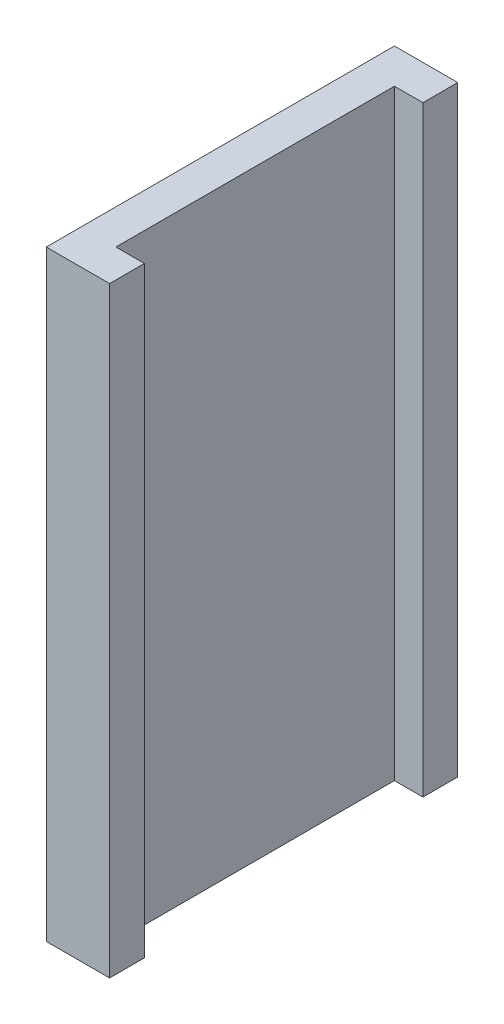
ISO-10303-21;
HEADER;
FILE_DESCRIPTION(('STEP AP214'),'2;1');
FILE_NAME('part.step','',(''),(''),'','','');
FILE_SCHEMA(('AUTOMOTIVE_DESIGN { 1 0 10303 214 1 1 1 1 }'));
ENDSEC;
DATA;
#1=APPLICATION_CONTEXT('core data for automotive mechanical design processes');
#2=APPLICATION_PROTOCOL_DEFINITION('international standard','automotive_design',2000,#1);
#3=PRODUCT_CONTEXT('',#1,'mechanical');
#4=PRODUCT('Part','Part','',(#3));
#5=PRODUCT_RELATED_PRODUCT_CATEGORY('part','',(#4));
#6=PRODUCT_DEFINITION_FORMATION('','',#4);
#7=PRODUCT_DEFINITION_CONTEXT('part definition',#1,'design');
#8=PRODUCT_DEFINITION('design','',#6,#7);
#9=PRODUCT_DEFINITION_SHAPE('','',#8);
#10=(LENGTH_UNIT() NAMED_UNIT(*) SI_UNIT(.MILLI.,.METRE.));
#11=(NAMED_UNIT(*) PLANE_ANGLE_UNIT() SI_UNIT($,.RADIAN.));
#12=(NAMED_UNIT(*) SI_UNIT($,.STERADIAN.) SOLID_ANGLE_UNIT());
#13=UNCERTAINTY_MEASURE_WITH_UNIT(LENGTH_MEASURE(1.E-05),#10,'distance_accuracy_value','');
#14=(GEOMETRIC_REPRESENTATION_CONTEXT(3) GLOBAL_UNCERTAINTY_ASSIGNED_CONTEXT((#13)) GLOBAL_UNIT_ASSIGNED_CONTEXT((#10,
#11,#12)) REPRESENTATION_CONTEXT('',''));
#15=CARTESIAN_POINT('',(0.,0.,0.));
#16=DIRECTION('',(0.,0.,1.));
#17=DIRECTION('',(1.,0.,0.));
#18=AXIS2_PLACEMENT_3D('',#15,#16,#17);
#19=CARTESIAN_POINT('',(0.1,0.,0.));
#20=DIRECTION('',(1.,0.,0.));
#21=DIRECTION('',(0.,0.,-1.));
#22=AXIS2_PLACEMENT_3D('',#19,#20,#21);
#23=PLANE('',#22);
#24=DIRECTION('',(0.,0.,1.));
#25=VECTOR('',#24,1.);
#26=CARTESIAN_POINT('',(0.1,0.95,0.));
#27=LINE('',#26,#25);
#28=CARTESIAN_POINT('',(0.1,0.95,0.055));
#29=VERTEX_POINT('',#28);
#30=CARTESIAN_POINT('',(0.1,0.95,0.));
#31=VERTEX_POINT('',#30);
#32=EDGE_CURVE('E100',#29,#31,#27,.F.);
#33=ORIENTED_EDGE('',*,*,#32,.F.);
#34=DIRECTION('',(0.,1.,0.));
#35=VECTOR('',#34,1.);
#36=CARTESIAN_POINT('',(0.1,0.,0.055));
#37=LINE('',#36,#35);
#38=CARTESIAN_POINT('',(0.1,0.,0.055));
#39=VERTEX_POINT('',#38);
#40=EDGE_CURVE('E99',#39,#29,#37,.T.);
#41=ORIENTED_EDGE('',*,*,#40,.F.);
#42=DIRECTION('',(0.,0.,1.));
#43=VECTOR('',#42,1.);
#44=CARTESIAN_POINT('',(0.1,0.,0.));
#45=LINE('',#44,#43);
#46=CARTESIAN_POINT('',(0.1,0.,0.));
#47=VERTEX_POINT('',#46);
#48=EDGE_CURVE('E84',#39,#47,#45,.F.);
#49=ORIENTED_EDGE('',*,*,#48,.T.);
#50=DIRECTION('',(0.,1.,0.));
#51=VECTOR('',#50,1.);
#52=CARTESIAN_POINT('',(0.1,0.,0.));
#53=LINE('',#52,#51);
#54=EDGE_CURVE('E110',#47,#31,#53,.T.);
#55=ORIENTED_EDGE('',*,*,#54,.T.);
#56=EDGE_LOOP('',(#33,#41,#49,#55));
#57=FACE_BOUND('',#56,.T.);
#58=ADVANCED_FACE('F17',(#57),#23,.T.);
#59=CARTESIAN_POINT('',(0.055,0.,0.495));
#60=DIRECTION('',(0.,0.,1.));
#61=DIRECTION('',(1.,0.,0.));
#62=AXIS2_PLACEMENT_3D('',#59,#60,#61);
#63=PLANE('',#62);
#64=DIRECTION('',(1.,0.,0.));
#65=VECTOR('',#64,1.);
#66=CARTESIAN_POINT('',(0.,0.,0.495));
#67=LINE('',#66,#65);
#68=CARTESIAN_POINT('',(0.1,0.,0.495));
#69=VERTEX_POINT('',#68);
#70=CARTESIAN_POINT('',(0.055,0.,0.495));
#71=VERTEX_POINT('',#70);
#72=EDGE_CURVE('E112',#69,#71,#67,.F.);
#73=ORIENTED_EDGE('',*,*,#72,.T.);
#74=DIRECTION('',(0.,1.,0.));
#75=VECTOR('',#74,1.);
#76=CARTESIAN_POINT('',(0.055,0.,0.495));
#77=LINE('',#76,#75);
#78=CARTESIAN_POINT('',(0.055,0.95,0.495));
#79=VERTEX_POINT('',#78);
#80=EDGE_CURVE('E20',#79,#71,#77,.F.);
#81=ORIENTED_EDGE('',*,*,#80,.F.);
#82=DIRECTION('',(1.,0.,0.));
#83=VECTOR('',#82,1.);
#84=CARTESIAN_POINT('',(0.,0.95,0.495));
#85=LINE('',#84,#83);
#86=CARTESIAN_POINT('',(0.1,0.95,0.495));
#87=VERTEX_POINT('',#86);
#88=EDGE_CURVE('E226',#87,#79,#85,.F.);
#89=ORIENTED_EDGE('',*,*,#88,.F.);
#90=DIRECTION('',(0.,1.,0.));
#91=VECTOR('',#90,1.);
#92=CARTESIAN_POINT('',(0.1,0.,0.495));
#93=LINE('',#92,#91);
#94=EDGE_CURVE('E78',#69,#87,#93,.T.);
#95=ORIENTED_EDGE('',*,*,#94,.F.);
#96=EDGE_LOOP('',(#73,#81,#89,#95));
#97=FACE_BOUND('',#96,.T.);
#98=ADVANCED_FACE('F124',(#97),#63,.F.);
#99=CARTESIAN_POINT('',(0.055,0.,0.055));
#100=DIRECTION('',(1.,0.,0.));
#101=DIRECTION('',(0.,0.,-1.));
#102=AXIS2_PLACEMENT_3D('',#99,#100,#101);
#103=PLANE('',#102);
#104=DIRECTION('',(0.,0.,1.));
#105=VECTOR('',#104,1.);
#106=CARTESIAN_POINT('',(0.055,0.95,0.));
#107=LINE('',#106,#105);
#108=CARTESIAN_POINT('',(0.055,0.95,0.055));
#109=VERTEX_POINT('',#108);
#110=EDGE_CURVE('E123',#79,#109,#107,.F.);
#111=ORIENTED_EDGE('',*,*,#110,.F.);
#112=ORIENTED_EDGE('',*,*,#80,.T.);
#113=DIRECTION('',(0.,0.,1.));
#114=VECTOR('',#113,1.);
#115=CARTESIAN_POINT('',(0.055,0.,0.));
#116=LINE('',#115,#114);
#117=CARTESIAN_POINT('',(0.055,0.,0.055));
#118=VERTEX_POINT('',#117);
#119=EDGE_CURVE('E108',#71,#118,#116,.F.);
#120=ORIENTED_EDGE('',*,*,#119,.T.);
#121=DIRECTION('',(0.,1.,0.));
#122=VECTOR('',#121,1.);
#123=CARTESIAN_POINT('',(0.055,0.,0.055));
#124=LINE('',#123,#122);
#125=EDGE_CURVE('E104',#109,#118,#124,.F.);
#126=ORIENTED_EDGE('',*,*,#125,.F.);
#127=EDGE_LOOP('',(#111,#112,#120,#126));
#128=FACE_BOUND('',#127,.T.);
#129=ADVANCED_FACE('F122',(#128),#103,.T.);
#130=CARTESIAN_POINT('',(0.055,0.,0.055));
#131=DIRECTION('',(0.,0.,1.));
#132=DIRECTION('',(1.,0.,0.));
#133=AXIS2_PLACEMENT_3D('',#130,#131,#132);
#134=PLANE('',#133);
#135=DIRECTION('',(1.,0.,0.));
#136=VECTOR('',#135,1.);
#137=CARTESIAN_POINT('',(0.,0.,0.055));
#138=LINE('',#137,#136);
#139=EDGE_CURVE('E89',#118,#39,#138,.T.);
#140=ORIENTED_EDGE('',*,*,#139,.T.);
#141=ORIENTED_EDGE('',*,*,#40,.T.);
#142=DIRECTION('',(1.,0.,0.));
#143=VECTOR('',#142,1.);
#144=CARTESIAN_POINT('',(0.,0.95,0.055));
#145=LINE('',#144,#143);
#146=EDGE_CURVE('E240',#109,#29,#145,.T.);
#147=ORIENTED_EDGE('',*,*,#146,.F.);
#148=ORIENTED_EDGE('',*,*,#125,.T.);
#149=EDGE_LOOP('',(#140,#141,#147,#148));
#150=FACE_BOUND('',#149,.T.);
#151=ADVANCED_FACE('F106',(#150),#134,.T.);
#152=CARTESIAN_POINT('',(0.1,0.,0.));
#153=DIRECTION('',(1.,0.,0.));
#154=DIRECTION('',(0.,0.,-1.));
#155=AXIS2_PLACEMENT_3D('',#152,#153,#154);
#156=PLANE('',#155);
#157=DIRECTION('',(0.,0.,1.));
#158=VECTOR('',#157,1.);
#159=CARTESIAN_POINT('',(0.1,0.95,0.));
#160=LINE('',#159,#158);
#161=CARTESIAN_POINT('',(0.1,0.95,0.55));
#162=VERTEX_POINT('',#161);
#163=EDGE_CURVE('E224',#162,#87,#160,.F.);
#164=ORIENTED_EDGE('',*,*,#163,.F.);
#165=DIRECTION('',(0.,1.,0.));
#166=VECTOR('',#165,1.);
#167=CARTESIAN_POINT('',(0.1,0.,0.55));
#168=LINE('',#167,#166);
#169=CARTESIAN_POINT('',(0.1,0.,0.55));
#170=VERTEX_POINT('',#169);
#171=EDGE_CURVE('E225',#170,#162,#168,.T.);
#172=ORIENTED_EDGE('',*,*,#171,.F.);
#173=DIRECTION('',(0.,0.,1.));
#174=VECTOR('',#173,1.);
#175=CARTESIAN_POINT('',(0.1,0.,0.));
#176=LINE('',#175,#174);
#177=EDGE_CURVE('E96',#170,#69,#176,.F.);
#178=ORIENTED_EDGE('',*,*,#177,.T.);
#179=ORIENTED_EDGE('',*,*,#94,.T.);
#180=EDGE_LOOP('',(#164,#172,#178,#179));
#181=FACE_BOUND('',#180,.T.);
#182=ADVANCED_FACE('F153',(#181),#156,.T.);
#183=CARTESIAN_POINT('',(0.,0.,0.));
#184=DIRECTION('',(0.,1.,0.));
#185=DIRECTION('',(0.,0.,1.));
#186=AXIS2_PLACEMENT_3D('',#183,#184,#185);
#187=PLANE('',#186);
#188=ORIENTED_EDGE('',*,*,#119,.F.);
#189=ORIENTED_EDGE('',*,*,#72,.F.);
#190=ORIENTED_EDGE('',*,*,#177,.F.);
#191=DIRECTION('',(1.,0.,0.));
#192=VECTOR('',#191,1.);
#193=CARTESIAN_POINT('',(0.,0.,0.55));
#194=LINE('',#193,#192);
#195=CARTESIAN_POINT('',(0.,0.,0.55));
#196=VERTEX_POINT('',#195);
#197=EDGE_CURVE('E234',#196,#170,#194,.T.);
#198=ORIENTED_EDGE('',*,*,#197,.F.);
#199=DIRECTION('',(0.,0.,-1.));
#200=VECTOR('',#199,1.);
#201=CARTESIAN_POINT('',(0.,0.,0.));
#202=LINE('',#201,#200);
#203=CARTESIAN_POINT('',(0.,0.,0.));
#204=VERTEX_POINT('',#203);
#205=EDGE_CURVE('E230',#196,#204,#202,.T.);
#206=ORIENTED_EDGE('',*,*,#205,.T.);
#207=DIRECTION('',(1.,0.,0.));
#208=VECTOR('',#207,1.);
#209=CARTESIAN_POINT('',(0.,0.,0.));
#210=LINE('',#209,#208);
#211=EDGE_CURVE('E92',#204,#47,#210,.T.);
#212=ORIENTED_EDGE('',*,*,#211,.T.);
#213=ORIENTED_EDGE('',*,*,#48,.F.);
#214=ORIENTED_EDGE('',*,*,#139,.F.);
#215=EDGE_LOOP('',(#188,#189,#190,#198,#206,#212,#213,#214));
#216=FACE_BOUND('',#215,.T.);
#217=ADVANCED_FACE('F87',(#216),#187,.F.);
#218=CARTESIAN_POINT('',(0.,0.,0.));
#219=DIRECTION('',(0.,0.,1.));
#220=DIRECTION('',(1.,0.,0.));
#221=AXIS2_PLACEMENT_3D('',#218,#219,#220);
#222=PLANE('',#221);
#223=ORIENTED_EDGE('',*,*,#54,.F.);
#224=ORIENTED_EDGE('',*,*,#211,.F.);
#225=DIRECTION('',(0.,1.,0.));
#226=VECTOR('',#225,1.);
#227=CARTESIAN_POINT('',(0.,0.,0.));
#228=LINE('',#227,#226);
#229=CARTESIAN_POINT('',(0.,0.95,0.));
#230=VERTEX_POINT('',#229);
#231=EDGE_CURVE('E232',#204,#230,#228,.T.);
#232=ORIENTED_EDGE('',*,*,#231,.T.);
#233=DIRECTION('',(1.,0.,0.));
#234=VECTOR('',#233,1.);
#235=CARTESIAN_POINT('',(0.,0.95,0.));
#236=LINE('',#235,#234);
#237=EDGE_CURVE('E227',#31,#230,#236,.F.);
#238=ORIENTED_EDGE('',*,*,#237,.F.);
#239=EDGE_LOOP('',(#223,#224,#232,#238));
#240=FACE_BOUND('',#239,.T.);
#241=ADVANCED_FACE('F146',(#240),#222,.F.);
#242=CARTESIAN_POINT('',(0.,0.95,0.));
#243=DIRECTION('',(0.,1.,0.));
#244=DIRECTION('',(0.,0.,1.));
#245=AXIS2_PLACEMENT_3D('',#242,#243,#244);
#246=PLANE('',#245);
#247=ORIENTED_EDGE('',*,*,#110,.T.);
#248=ORIENTED_EDGE('',*,*,#146,.T.);
#249=ORIENTED_EDGE('',*,*,#32,.T.);
#250=ORIENTED_EDGE('',*,*,#237,.T.);
#251=DIRECTION('',(0.,0.,-1.));
#252=VECTOR('',#251,1.);
#253=CARTESIAN_POINT('',(0.,0.95,0.));
#254=LINE('',#253,#252);
#255=CARTESIAN_POINT('',(0.,0.95,0.55));
#256=VERTEX_POINT('',#255);
#257=EDGE_CURVE('E26',#230,#256,#254,.F.);
#258=ORIENTED_EDGE('',*,*,#257,.T.);
#259=DIRECTION('',(1.,0.,0.));
#260=VECTOR('',#259,1.);
#261=CARTESIAN_POINT('',(0.,0.95,0.55));
#262=LINE('',#261,#260);
#263=EDGE_CURVE('E34',#162,#256,#262,.F.);
#264=ORIENTED_EDGE('',*,*,#263,.F.);
#265=ORIENTED_EDGE('',*,*,#163,.T.);
#266=ORIENTED_EDGE('',*,*,#88,.T.);
#267=EDGE_LOOP('',(#247,#248,#249,#250,#258,#264,#265,#266));
#268=FACE_BOUND('',#267,.T.);
#269=ADVANCED_FACE('F140',(#268),#246,.T.);
#270=CARTESIAN_POINT('',(0.,0.,0.55));
#271=DIRECTION('',(0.,0.,1.));
#272=DIRECTION('',(1.,0.,0.));
#273=AXIS2_PLACEMENT_3D('',#270,#271,#272);
#274=PLANE('',#273);
#275=ORIENTED_EDGE('',*,*,#171,.T.);
#276=ORIENTED_EDGE('',*,*,#263,.T.);
#277=DIRECTION('',(0.,1.,0.));
#278=VECTOR('',#277,1.);
#279=CARTESIAN_POINT('',(0.,0.,0.55));
#280=LINE('',#279,#278);
#281=EDGE_CURVE('E11',#256,#196,#280,.F.);
#282=ORIENTED_EDGE('',*,*,#281,.T.);
#283=ORIENTED_EDGE('',*,*,#197,.T.);
#284=EDGE_LOOP('',(#275,#276,#282,#283));
#285=FACE_BOUND('',#284,.T.);
#286=ADVANCED_FACE('F134',(#285),#274,.T.);
#287=CARTESIAN_POINT('',(0.,0.,0.));
#288=DIRECTION('',(1.,0.,0.));
#289=DIRECTION('',(0.,0.,-1.));
#290=AXIS2_PLACEMENT_3D('',#287,#288,#289);
#291=PLANE('',#290);
#292=ORIENTED_EDGE('',*,*,#257,.F.);
#293=ORIENTED_EDGE('',*,*,#231,.F.);
#294=ORIENTED_EDGE('',*,*,#205,.F.);
#295=ORIENTED_EDGE('',*,*,#281,.F.);
#296=EDGE_LOOP('',(#292,#293,#294,#295));
#297=FACE_BOUND('',#296,.T.);
#298=ADVANCED_FACE('F132',(#297),#291,.F.);
#299=CLOSED_SHELL('',(#58,#98,#129,#151,#182,#217,#241,#269,#286,#298));
#300=MANIFOLD_SOLID_BREP('B1',#299);
#301=ADVANCED_BREP_SHAPE_REPRESENTATION('',(#18,#300),#14);
#302=SHAPE_DEFINITION_REPRESENTATION(#9,#301);
ENDSEC;
END-ISO-10303-21;
